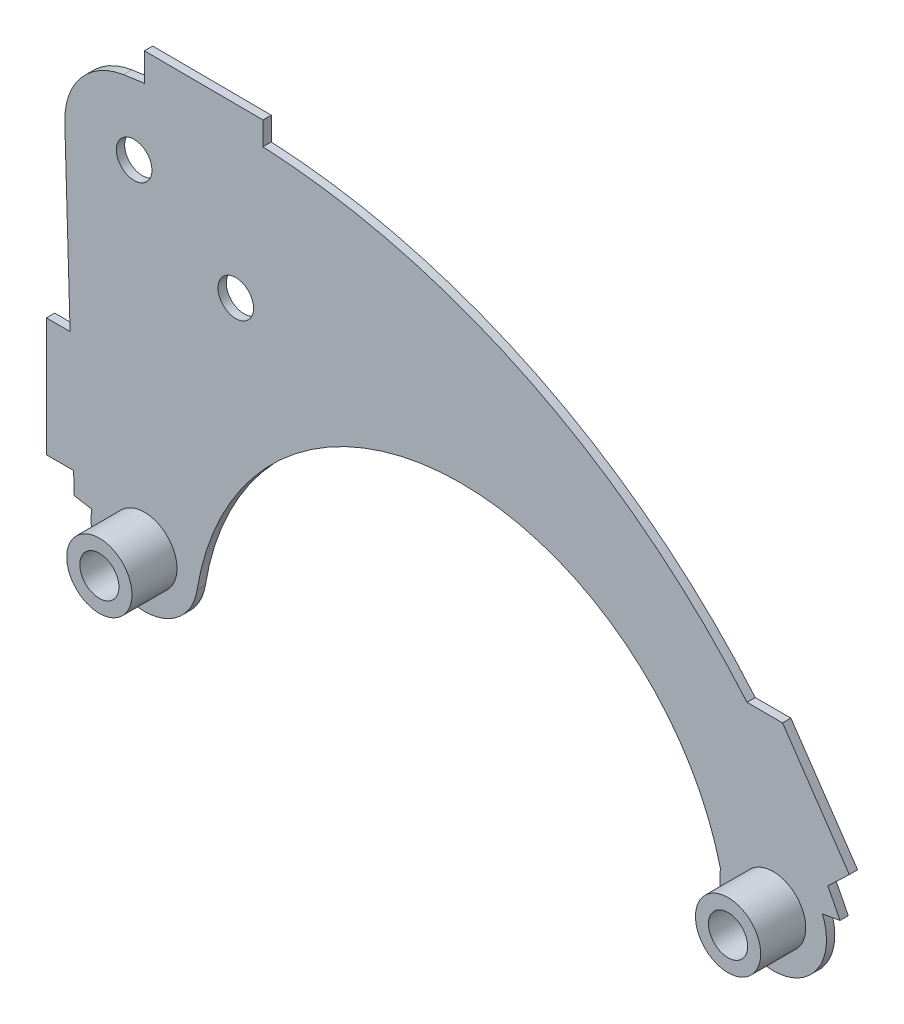
ISO-10303-21;
HEADER;
FILE_DESCRIPTION(('STEP AP214'),'2;1');
FILE_NAME('part.step','',(''),(''),'','','');
FILE_SCHEMA(('AUTOMOTIVE_DESIGN { 1 0 10303 214 1 1 1 1 }'));
ENDSEC;
DATA;
#1=APPLICATION_CONTEXT('core data for automotive mechanical design processes');
#2=APPLICATION_PROTOCOL_DEFINITION('international standard','automotive_design',2000,#1);
#3=PRODUCT_CONTEXT('',#1,'mechanical');
#4=PRODUCT('Part','Part','',(#3));
#5=PRODUCT_RELATED_PRODUCT_CATEGORY('part','',(#4));
#6=PRODUCT_DEFINITION_FORMATION('','',#4);
#7=PRODUCT_DEFINITION_CONTEXT('part definition',#1,'design');
#8=PRODUCT_DEFINITION('design','',#6,#7);
#9=PRODUCT_DEFINITION_SHAPE('','',#8);
#10=(LENGTH_UNIT() NAMED_UNIT(*) SI_UNIT(.MILLI.,.METRE.));
#11=(NAMED_UNIT(*) PLANE_ANGLE_UNIT() SI_UNIT($,.RADIAN.));
#12=(NAMED_UNIT(*) SI_UNIT($,.STERADIAN.) SOLID_ANGLE_UNIT());
#13=UNCERTAINTY_MEASURE_WITH_UNIT(LENGTH_MEASURE(1.E-05),#10,'distance_accuracy_value','');
#14=(GEOMETRIC_REPRESENTATION_CONTEXT(3) GLOBAL_UNCERTAINTY_ASSIGNED_CONTEXT((#13)) GLOBAL_UNIT_ASSIGNED_CONTEXT((#10,
#11,#12)) REPRESENTATION_CONTEXT('',''));
#15=CARTESIAN_POINT('',(0.,0.,0.));
#16=DIRECTION('',(0.,0.,1.));
#17=DIRECTION('',(1.,0.,0.));
#18=AXIS2_PLACEMENT_3D('',#15,#16,#17);
#19=CARTESIAN_POINT('',(-192.707076218779,-184.284598923351,7.));
#20=DIRECTION('',(0.,0.,-1.));
#21=DIRECTION('',(-1.,0.,0.));
#22=AXIS2_PLACEMENT_3D('',#19,#20,#21);
#23=CYLINDRICAL_SURFACE('',#22,573.469503846789);
#24=CARTESIAN_POINT('',(-192.707076218779,-184.284598923351,0.));
#25=DIRECTION('',(0.,0.,1.));
#26=DIRECTION('',(1.,0.,0.));
#27=AXIS2_PLACEMENT_3D('',#24,#25,#26);
#28=CIRCLE('',#27,573.469503846789);
#29=CARTESIAN_POINT('',(322.942948353425,66.6582710709314,0.));
#30=VERTEX_POINT('',#29);
#31=CARTESIAN_POINT('',(312.652861422029,86.7847746140521,0.));
#32=VERTEX_POINT('',#31);
#33=EDGE_CURVE('E344',#30,#32,#28,.T.);
#34=ORIENTED_EDGE('',*,*,#33,.T.);
#35=DIRECTION('',(0.,0.,1.));
#36=VECTOR('',#35,1.);
#37=CARTESIAN_POINT('',(312.652861422028,86.7847746140535,-132.090595462372));
#38=LINE('',#37,#36);
#39=CARTESIAN_POINT('',(312.652861422029,86.7847746140521,7.));
#40=VERTEX_POINT('',#39);
#41=EDGE_CURVE('E64',#32,#40,#38,.T.);
#42=ORIENTED_EDGE('',*,*,#41,.T.);
#43=CARTESIAN_POINT('',(-192.707076218779,-184.284598923351,7.));
#44=DIRECTION('',(0.,0.,1.));
#45=DIRECTION('',(1.,0.,0.));
#46=AXIS2_PLACEMENT_3D('',#43,#44,#45);
#47=CIRCLE('',#46,573.469503846789);
#48=CARTESIAN_POINT('',(322.942948353425,66.6582710709314,7.));
#49=VERTEX_POINT('',#48);
#50=EDGE_CURVE('E215',#49,#40,#47,.T.);
#51=ORIENTED_EDGE('',*,*,#50,.F.);
#52=DIRECTION('',(0.,0.,-1.));
#53=VECTOR('',#52,1.);
#54=CARTESIAN_POINT('',(322.942948353425,66.6582710709314,7.));
#55=LINE('',#54,#53);
#56=EDGE_CURVE('E11',#49,#30,#55,.T.);
#57=ORIENTED_EDGE('',*,*,#56,.T.);
#58=EDGE_LOOP('',(#34,#42,#51,#57));
#59=FACE_BOUND('',#58,.T.);
#60=ADVANCED_FACE('F41',(#59),#23,.T.);
#61=CARTESIAN_POINT('',(244.528320180963,186.784774614054,7.));
#62=VERTEX_POINT('',#61);
#63=CARTESIAN_POINT('',(-163.635450853397,388.447548280642,7.));
#64=VERTEX_POINT('',#63);
#65=EDGE_CURVE('E56',#62,#64,#47,.T.);
#66=ORIENTED_EDGE('',*,*,#65,.F.);
#67=DIRECTION('',(0.,0.,1.));
#68=VECTOR('',#67,1.);
#69=CARTESIAN_POINT('',(244.528320180963,186.784774614054,-132.090595462372));
#70=LINE('',#69,#68);
#71=CARTESIAN_POINT('',(244.528320180963,186.784774614054,0.));
#72=VERTEX_POINT('',#71);
#73=EDGE_CURVE('E223',#72,#62,#70,.T.);
#74=ORIENTED_EDGE('',*,*,#73,.F.);
#75=CARTESIAN_POINT('',(-163.635450853397,388.447548280642,0.));
#76=VERTEX_POINT('',#75);
#77=EDGE_CURVE('E347',#72,#76,#28,.T.);
#78=ORIENTED_EDGE('',*,*,#77,.T.);
#79=DIRECTION('',(0.,0.,-1.));
#80=VECTOR('',#79,1.);
#81=CARTESIAN_POINT('',(-163.635450853397,388.447548280642,7.));
#82=LINE('',#81,#80);
#83=EDGE_CURVE('E251',#76,#64,#82,.F.);
#84=ORIENTED_EDGE('',*,*,#83,.T.);
#85=EDGE_LOOP('',(#66,#74,#78,#84));
#86=FACE_BOUND('',#85,.T.);
#87=ADVANCED_FACE('F404',(#86),#23,.T.);
#88=CARTESIAN_POINT('',(-320.932430468004,-9.49371903301343,7.));
#89=DIRECTION('',(-0.999562749185393,-0.0295687409427409,0.));
#90=DIRECTION('',(0.0295687409427409,-0.999562749185393,0.));
#91=AXIS2_PLACEMENT_3D('',#88,#89,#90);
#92=PLANE('',#91);
#93=DIRECTION('',(0.,0.,1.));
#94=VECTOR('',#93,1.);
#95=CARTESIAN_POINT('',(-323.347893363374,72.1603066465592,-132.090595462372));
#96=LINE('',#95,#94);
#97=CARTESIAN_POINT('',(-323.347893363374,72.1603066465592,0.));
#98=VERTEX_POINT('',#97);
#99=CARTESIAN_POINT('',(-323.347893363374,72.1603066465592,7.));
#100=VERTEX_POINT('',#99);
#101=EDGE_CURVE('E257',#98,#100,#96,.T.);
#102=ORIENTED_EDGE('',*,*,#101,.F.);
#103=DIRECTION('',(-0.0295687409427408,0.999562749185393,0.));
#104=VECTOR('',#103,1.);
#105=CARTESIAN_POINT('',(-320.932430468004,-9.49371903301343,0.));
#106=LINE('',#105,#104);
#107=CARTESIAN_POINT('',(-322.811275447721,54.0200929637776,0.));
#108=VERTEX_POINT('',#107);
#109=EDGE_CURVE('E351',#108,#98,#106,.T.);
#110=ORIENTED_EDGE('',*,*,#109,.F.);
#111=DIRECTION('',(0.,0.,-1.));
#112=VECTOR('',#111,1.);
#113=CARTESIAN_POINT('',(-322.811275447721,54.0200929637776,7.));
#114=LINE('',#113,#112);
#115=CARTESIAN_POINT('',(-322.811275447721,54.0200929637776,7.));
#116=VERTEX_POINT('',#115);
#117=EDGE_CURVE('E380',#116,#108,#114,.T.);
#118=ORIENTED_EDGE('',*,*,#117,.F.);
#119=DIRECTION('',(-0.0295687409427408,0.999562749185393,0.));
#120=VECTOR('',#119,1.);
#121=CARTESIAN_POINT('',(-320.932430468004,-9.49371903301343,7.));
#122=LINE('',#121,#120);
#123=EDGE_CURVE('E312',#116,#100,#122,.T.);
#124=ORIENTED_EDGE('',*,*,#123,.T.);
#125=EDGE_LOOP('',(#102,#110,#118,#124));
#126=FACE_BOUND('',#125,.T.);
#127=ADVANCED_FACE('F432',(#126),#92,.T.);
#128=CARTESIAN_POINT('',(0.,0.,7.));
#129=DIRECTION('',(0.,0.,1.));
#130=DIRECTION('',(1.,0.,0.));
#131=AXIS2_PLACEMENT_3D('',#128,#129,#130);
#132=PLANE('',#131);
#133=ORIENTED_EDGE('',*,*,#50,.T.);
#134=DIRECTION('',(0.723263400313583,0.690572265419655,0.));
#135=VECTOR('',#134,1.);
#136=CARTESIAN_POINT('',(330.829684072874,104.140014199913,7.));
#137=LINE('',#136,#135);
#138=CARTESIAN_POINT('',(330.829684072874,104.140014199913,7.));
#139=VERTEX_POINT('',#138);
#140=EDGE_CURVE('E196',#40,#139,#137,.T.);
#141=ORIENTED_EDGE('',*,*,#140,.T.);
#142=DIRECTION('',(-0.563013638919106,0.826447604141404,0.));
#143=VECTOR('',#142,1.);
#144=CARTESIAN_POINT('',(274.528320180963,186.784774614053,7.));
#145=LINE('',#144,#143);
#146=CARTESIAN_POINT('',(274.528320180963,186.784774614053,7.));
#147=VERTEX_POINT('',#146);
#148=EDGE_CURVE('E205',#139,#147,#145,.T.);
#149=ORIENTED_EDGE('',*,*,#148,.T.);
#150=DIRECTION('',(-1.,0.,0.));
#151=VECTOR('',#150,1.);
#152=CARTESIAN_POINT('',(274.528320180963,186.784774614053,7.));
#153=LINE('',#152,#151);
#154=EDGE_CURVE('E202',#147,#62,#153,.T.);
#155=ORIENTED_EDGE('',*,*,#154,.T.);
#156=ORIENTED_EDGE('',*,*,#65,.T.);
#157=DIRECTION('',(0.,1.,0.));
#158=VECTOR('',#157,1.);
#159=CARTESIAN_POINT('',(-163.635450853396,408.029879984164,7.));
#160=LINE('',#159,#158);
#161=CARTESIAN_POINT('',(-163.635450853396,408.029879984164,7.));
#162=VERTEX_POINT('',#161);
#163=EDGE_CURVE('E241',#64,#162,#160,.T.);
#164=ORIENTED_EDGE('',*,*,#163,.T.);
#165=DIRECTION('',(-0.999986904375058,0.00511772199215999,0.));
#166=VECTOR('',#165,1.);
#167=CARTESIAN_POINT('',(-263.634141290902,408.541652183381,7.));
#168=LINE('',#167,#166);
#169=CARTESIAN_POINT('',(-263.634141290902,408.541652183381,7.));
#170=VERTEX_POINT('',#169);
#171=EDGE_CURVE('E228',#162,#170,#168,.T.);
#172=ORIENTED_EDGE('',*,*,#171,.T.);
#173=DIRECTION('',(0.,-1.,0.));
#174=VECTOR('',#173,1.);
#175=CARTESIAN_POINT('',(-263.634141290902,408.541652183381,7.));
#176=LINE('',#175,#174);
#177=CARTESIAN_POINT('',(-263.634141290902,384.781849993238,7.));
#178=VERTEX_POINT('',#177);
#179=EDGE_CURVE('E238',#170,#178,#176,.T.);
#180=ORIENTED_EDGE('',*,*,#179,.T.);
#181=CARTESIAN_POINT('',(-281.327086526287,382.296168148193,7.));
#182=VERTEX_POINT('',#181);
#183=EDGE_CURVE('E306',#178,#182,#47,.T.);
#184=ORIENTED_EDGE('',*,*,#183,.T.);
#185=CARTESIAN_POINT('',(-272.286901183886,324.498892702243,7.));
#186=DIRECTION('',(0.,0.,1.));
#187=DIRECTION('',(1.,0.,0.));
#188=AXIS2_PLACEMENT_3D('',#185,#186,#187);
#189=CIRCLE('',#188,58.5);
#190=CARTESIAN_POINT('',(-330.761322011232,322.769121357092,7.));
#191=VERTEX_POINT('',#190);
#192=EDGE_CURVE('E308',#182,#191,#189,.T.);
#193=ORIENTED_EDGE('',*,*,#192,.T.);
#194=CARTESIAN_POINT('',(-326.306060918821,172.160306646559,7.));
#195=VERTEX_POINT('',#194);
#196=EDGE_CURVE('E311',#195,#191,#122,.T.);
#197=ORIENTED_EDGE('',*,*,#196,.F.);
#198=DIRECTION('',(-1.,0.,0.));
#199=VECTOR('',#198,1.);
#200=CARTESIAN_POINT('',(-326.306060918821,172.160306646559,7.));
#201=LINE('',#200,#199);
#202=CARTESIAN_POINT('',(-346.306060918821,172.160306646559,7.));
#203=VERTEX_POINT('',#202);
#204=EDGE_CURVE('E253',#195,#203,#201,.T.);
#205=ORIENTED_EDGE('',*,*,#204,.T.);
#206=DIRECTION('',(0.,-1.,0.));
#207=VECTOR('',#206,1.);
#208=CARTESIAN_POINT('',(-346.306060918821,172.160306646559,7.));
#209=LINE('',#208,#207);
#210=CARTESIAN_POINT('',(-346.306060918821,72.1603066465592,7.));
#211=VERTEX_POINT('',#210);
#212=EDGE_CURVE('E262',#203,#211,#209,.T.);
#213=ORIENTED_EDGE('',*,*,#212,.T.);
#214=DIRECTION('',(1.,0.,0.));
#215=VECTOR('',#214,1.);
#216=CARTESIAN_POINT('',(-346.306060918821,72.1603066465592,7.));
#217=LINE('',#216,#215);
#218=EDGE_CURVE('E265',#211,#100,#217,.T.);
#219=ORIENTED_EDGE('',*,*,#218,.T.);
#220=ORIENTED_EDGE('',*,*,#123,.F.);
#221=DIRECTION('',(-0.986285569280313,0.165047798620306,0.));
#222=VECTOR('',#221,1.);
#223=CARTESIAN_POINT('',(-8.62227936014492E-06,-5.15246478796E-05,7.));
#224=LINE('',#223,#222);
#225=CARTESIAN_POINT('',(-308.016991908516,51.544375984473,7.));
#226=VERTEX_POINT('',#225);
#227=EDGE_CURVE('E315',#226,#116,#224,.T.);
#228=ORIENTED_EDGE('',*,*,#227,.F.);
#229=CARTESIAN_POINT('',(-263.634141290902,44.1172250465592,7.));
#230=DIRECTION('',(0.,0.,1.));
#231=DIRECTION('',(1.,0.,0.));
#232=AXIS2_PLACEMENT_3D('',#229,#230,#231);
#233=CIRCLE('',#232,44.9999999999999);
#234=CARTESIAN_POINT('',(-263.634141290902,-0.882774953440794,7.));
#235=VERTEX_POINT('',#234);
#236=EDGE_CURVE('E318',#226,#235,#233,.T.);
#237=ORIENTED_EDGE('',*,*,#236,.T.);
#238=DIRECTION('',(0.999974002488679,0.00721071055936465,0.));
#239=VECTOR('',#238,1.);
#240=CARTESIAN_POINT('',(-0.0073422157700782,1.0182110112859,7.));
#241=LINE('',#240,#239);
#242=CARTESIAN_POINT('',(-262.985194212018,-0.878095462231509,7.));
#243=VERTEX_POINT('',#242);
#244=EDGE_CURVE('E320',#235,#243,#241,.T.);
#245=ORIENTED_EDGE('',*,*,#244,.T.);
#246=CARTESIAN_POINT('',(-219.209238470738,36.9458925749064,7.));
#247=VERTEX_POINT('',#246);
#248=EDGE_CURVE('E321',#243,#247,#233,.T.);
#249=ORIENTED_EDGE('',*,*,#248,.T.);
#250=CARTESIAN_POINT('',(3.21144164888322,1.04142133349768,7.));
#251=DIRECTION('',(0.,0.,1.));
#252=DIRECTION('',(1.,0.,0.));
#253=AXIS2_PLACEMENT_3D('',#250,#251,#252);
#254=CIRCLE('',#253,225.3);
#255=CARTESIAN_POINT('',(222.170009850152,54.1190570311286,7.));
#256=VERTEX_POINT('',#255);
#257=EDGE_CURVE('E323',#256,#247,#254,.T.);
#258=ORIENTED_EDGE('',*,*,#257,.F.);
#259=CARTESIAN_POINT('',(266.568301500018,46.7847746140535,7.));
#260=DIRECTION('',(0.,0.,1.));
#261=DIRECTION('',(1.,0.,0.));
#262=AXIS2_PLACEMENT_3D('',#259,#260,#261);
#263=CIRCLE('',#262,45.);
#264=CARTESIAN_POINT('',(308.11587010362,64.0705937479262,7.));
#265=VERTEX_POINT('',#264);
#266=EDGE_CURVE('E326',#256,#265,#263,.T.);
#267=ORIENTED_EDGE('',*,*,#266,.T.);
#268=DIRECTION('',(0.985110024766589,0.171925097366177,0.));
#269=VECTOR('',#268,1.);
#270=CARTESIAN_POINT('',(-1.74396232257102,9.99269328968787,7.));
#271=LINE('',#270,#269);
#272=EDGE_CURVE('E304',#265,#49,#271,.T.);
#273=ORIENTED_EDGE('',*,*,#272,.T.);
#274=EDGE_LOOP('',(#133,#141,#149,#155,#156,#164,#172,#180,#184,#193,#197,#205,#213,#219,#220,
#228,#237,#245,#249,#258,#267,#273));
#275=FACE_BOUND('',#274,.T.);
#276=CARTESIAN_POINT('',(-263.634141290902,44.1172250465592,7.));
#277=DIRECTION('',(0.,0.,1.));
#278=DIRECTION('',(1.,0.,0.));
#279=AXIS2_PLACEMENT_3D('',#276,#277,#278);
#280=CIRCLE('',#279,27.5);
#281=CARTESIAN_POINT('',(-236.134141290902,44.1172250465592,7.));
#282=VERTEX_POINT('',#281);
#283=EDGE_CURVE('E290',#282,#282,#280,.T.);
#284=ORIENTED_EDGE('',*,*,#283,.F.);
#285=EDGE_LOOP('',(#284));
#286=FACE_BOUND('',#285,.T.);
#287=CARTESIAN_POINT('',(-186.584414744995,266.470160007209,7.));
#288=DIRECTION('',(0.,0.,1.));
#289=DIRECTION('',(1.,0.,0.));
#290=AXIS2_PLACEMENT_3D('',#287,#288,#289);
#291=CIRCLE('',#290,15.);
#292=CARTESIAN_POINT('',(-171.584414744995,266.470160007209,7.));
#293=VERTEX_POINT('',#292);
#294=EDGE_CURVE('E297',#293,#293,#291,.T.);
#295=ORIENTED_EDGE('',*,*,#294,.F.);
#296=EDGE_LOOP('',(#295));
#297=FACE_BOUND('',#296,.T.);
#298=CARTESIAN_POINT('',(-272.286901183886,324.498892702243,7.));
#299=DIRECTION('',(0.,0.,1.));
#300=DIRECTION('',(1.,0.,0.));
#301=AXIS2_PLACEMENT_3D('',#298,#299,#300);
#302=CIRCLE('',#301,15.);
#303=CARTESIAN_POINT('',(-257.286901183886,324.498892702243,7.));
#304=VERTEX_POINT('',#303);
#305=EDGE_CURVE('E300',#304,#304,#302,.T.);
#306=ORIENTED_EDGE('',*,*,#305,.F.);
#307=EDGE_LOOP('',(#306));
#308=FACE_BOUND('',#307,.T.);
#309=CARTESIAN_POINT('',(266.568301500018,46.7847746140535,7.));
#310=DIRECTION('',(0.,0.,1.));
#311=DIRECTION('',(1.,0.,0.));
#312=AXIS2_PLACEMENT_3D('',#309,#310,#311);
#313=CIRCLE('',#312,27.5);
#314=CARTESIAN_POINT('',(294.068301500018,46.7847746140535,7.));
#315=VERTEX_POINT('',#314);
#316=EDGE_CURVE('E281',#315,#315,#313,.T.);
#317=ORIENTED_EDGE('',*,*,#316,.F.);
#318=EDGE_LOOP('',(#317));
#319=FACE_BOUND('',#318,.T.);
#320=ADVANCED_FACE('F212',(#275,#286,#297,#308,#319),#132,.T.);
#321=CARTESIAN_POINT('',(-1.74396232257102,9.99269328968787,7.));
#322=DIRECTION('',(-0.171925097366177,0.985110024766589,0.));
#323=DIRECTION('',(-0.98511002476659,-0.171925097366177,0.));
#324=AXIS2_PLACEMENT_3D('',#321,#322,#323);
#325=PLANE('',#324);
#326=DIRECTION('',(0.985110024766589,0.171925097366177,0.));
#327=VECTOR('',#326,1.);
#328=CARTESIAN_POINT('',(-1.74396232257102,9.99269328968787,0.));
#329=LINE('',#328,#327);
#330=CARTESIAN_POINT('',(308.11587010362,64.0705937479262,0.));
#331=VERTEX_POINT('',#330);
#332=EDGE_CURVE('E340',#331,#30,#329,.T.);
#333=ORIENTED_EDGE('',*,*,#332,.T.);
#334=ORIENTED_EDGE('',*,*,#56,.F.);
#335=ORIENTED_EDGE('',*,*,#272,.F.);
#336=DIRECTION('',(0.,0.,-1.));
#337=VECTOR('',#336,1.);
#338=CARTESIAN_POINT('',(308.11587010362,64.0705937479262,7.));
#339=LINE('',#338,#337);
#340=EDGE_CURVE('E328',#265,#331,#339,.T.);
#341=ORIENTED_EDGE('',*,*,#340,.T.);
#342=EDGE_LOOP('',(#333,#334,#335,#341));
#343=FACE_BOUND('',#342,.T.);
#344=ADVANCED_FACE('F419',(#343),#325,.F.);
#345=ORIENTED_EDGE('',*,*,#183,.F.);
#346=DIRECTION('',(0.,0.,-1.));
#347=VECTOR('',#346,1.);
#348=CARTESIAN_POINT('',(-263.634141290902,384.781849993238,7.));
#349=LINE('',#348,#347);
#350=CARTESIAN_POINT('',(-263.634141290902,384.781849993238,0.));
#351=VERTEX_POINT('',#350);
#352=EDGE_CURVE('E248',#178,#351,#349,.T.);
#353=ORIENTED_EDGE('',*,*,#352,.T.);
#354=CARTESIAN_POINT('',(-281.327086526287,382.296168148193,0.));
#355=VERTEX_POINT('',#354);
#356=EDGE_CURVE('E343',#351,#355,#28,.T.);
#357=ORIENTED_EDGE('',*,*,#356,.T.);
#358=DIRECTION('',(0.,0.,-1.));
#359=VECTOR('',#358,1.);
#360=CARTESIAN_POINT('',(-281.327086526287,382.296168148193,7.));
#361=LINE('',#360,#359);
#362=EDGE_CURVE('E49',#182,#355,#361,.T.);
#363=ORIENTED_EDGE('',*,*,#362,.F.);
#364=EDGE_LOOP('',(#345,#353,#357,#363));
#365=FACE_BOUND('',#364,.T.);
#366=ADVANCED_FACE('F417',(#365),#23,.T.);
#367=CARTESIAN_POINT('',(-272.286901183886,324.498892702243,7.));
#368=DIRECTION('',(0.,0.,-1.));
#369=DIRECTION('',(-1.,0.,0.));
#370=AXIS2_PLACEMENT_3D('',#367,#368,#369);
#371=CYLINDRICAL_SURFACE('',#370,58.5);
#372=CARTESIAN_POINT('',(-272.286901183886,324.498892702243,0.));
#373=DIRECTION('',(0.,0.,1.));
#374=DIRECTION('',(1.,0.,0.));
#375=AXIS2_PLACEMENT_3D('',#372,#373,#374);
#376=CIRCLE('',#375,58.5);
#377=CARTESIAN_POINT('',(-330.761322011232,322.769121357092,0.));
#378=VERTEX_POINT('',#377);
#379=EDGE_CURVE('E346',#355,#378,#376,.T.);
#380=ORIENTED_EDGE('',*,*,#379,.T.);
#381=DIRECTION('',(0.,0.,-1.));
#382=VECTOR('',#381,1.);
#383=CARTESIAN_POINT('',(-330.761322011232,322.769121357092,7.));
#384=LINE('',#383,#382);
#385=EDGE_CURVE('E382',#191,#378,#384,.T.);
#386=ORIENTED_EDGE('',*,*,#385,.F.);
#387=ORIENTED_EDGE('',*,*,#192,.F.);
#388=ORIENTED_EDGE('',*,*,#362,.T.);
#389=EDGE_LOOP('',(#380,#386,#387,#388));
#390=FACE_BOUND('',#389,.T.);
#391=ADVANCED_FACE('F389',(#390),#371,.T.);
#392=DIRECTION('',(0.,0.,1.));
#393=VECTOR('',#392,1.);
#394=CARTESIAN_POINT('',(-326.306060918821,172.160306646559,-132.090595462372));
#395=LINE('',#394,#393);
#396=CARTESIAN_POINT('',(-326.306060918821,172.160306646559,0.));
#397=VERTEX_POINT('',#396);
#398=EDGE_CURVE('E268',#397,#195,#395,.T.);
#399=ORIENTED_EDGE('',*,*,#398,.T.);
#400=ORIENTED_EDGE('',*,*,#196,.T.);
#401=ORIENTED_EDGE('',*,*,#385,.T.);
#402=EDGE_CURVE('E350',#397,#378,#106,.T.);
#403=ORIENTED_EDGE('',*,*,#402,.F.);
#404=EDGE_LOOP('',(#399,#400,#401,#403));
#405=FACE_BOUND('',#404,.T.);
#406=ADVANCED_FACE('F398',(#405),#92,.T.);
#407=CARTESIAN_POINT('',(-8.62227936014492E-06,-5.15246478796E-05,7.));
#408=DIRECTION('',(-0.165047798620306,-0.986285569280313,0.));
#409=DIRECTION('',(0.986285569280313,-0.165047798620306,0.));
#410=AXIS2_PLACEMENT_3D('',#407,#408,#409);
#411=PLANE('',#410);
#412=DIRECTION('',(-0.986285569280313,0.165047798620306,0.));
#413=VECTOR('',#412,1.);
#414=CARTESIAN_POINT('',(-8.62227936014492E-06,-5.15246478796E-05,0.));
#415=LINE('',#414,#413);
#416=CARTESIAN_POINT('',(-308.016991908516,51.544375984473,0.));
#417=VERTEX_POINT('',#416);
#418=EDGE_CURVE('E354',#417,#108,#415,.T.);
#419=ORIENTED_EDGE('',*,*,#418,.F.);
#420=DIRECTION('',(0.,0.,-1.));
#421=VECTOR('',#420,1.);
#422=CARTESIAN_POINT('',(-308.016991908516,51.544375984473,7.));
#423=LINE('',#422,#421);
#424=EDGE_CURVE('E378',#226,#417,#423,.T.);
#425=ORIENTED_EDGE('',*,*,#424,.F.);
#426=ORIENTED_EDGE('',*,*,#227,.T.);
#427=ORIENTED_EDGE('',*,*,#117,.T.);
#428=EDGE_LOOP('',(#419,#425,#426,#427));
#429=FACE_BOUND('',#428,.T.);
#430=ADVANCED_FACE('F444',(#429),#411,.T.);
#431=CARTESIAN_POINT('',(-263.634141290902,44.1172250465592,7.));
#432=DIRECTION('',(0.,0.,-1.));
#433=DIRECTION('',(-1.,0.,0.));
#434=AXIS2_PLACEMENT_3D('',#431,#432,#433);
#435=CYLINDRICAL_SURFACE('',#434,44.9999999999999);
#436=CARTESIAN_POINT('',(-263.634141290902,44.1172250465592,0.));
#437=DIRECTION('',(0.,0.,1.));
#438=DIRECTION('',(1.,0.,0.));
#439=AXIS2_PLACEMENT_3D('',#436,#437,#438);
#440=CIRCLE('',#439,44.9999999999999);
#441=CARTESIAN_POINT('',(-263.634141290902,-0.882774953440794,0.));
#442=VERTEX_POINT('',#441);
#443=EDGE_CURVE('E357',#417,#442,#440,.T.);
#444=ORIENTED_EDGE('',*,*,#443,.T.);
#445=DIRECTION('',(0.,0.,-1.));
#446=VECTOR('',#445,1.);
#447=CARTESIAN_POINT('',(-263.634141290902,-0.882774953440794,7.));
#448=LINE('',#447,#446);
#449=EDGE_CURVE('E375',#235,#442,#448,.T.);
#450=ORIENTED_EDGE('',*,*,#449,.F.);
#451=ORIENTED_EDGE('',*,*,#236,.F.);
#452=ORIENTED_EDGE('',*,*,#424,.T.);
#453=EDGE_LOOP('',(#444,#450,#451,#452));
#454=FACE_BOUND('',#453,.T.);
#455=ADVANCED_FACE('F449',(#454),#435,.T.);
#456=CARTESIAN_POINT('',(-0.0073422157700782,1.0182110112859,7.));
#457=DIRECTION('',(-0.00721071055936465,0.999974002488679,0.));
#458=DIRECTION('',(-0.999974002488679,-0.00721071055936465,0.));
#459=AXIS2_PLACEMENT_3D('',#456,#457,#458);
#460=PLANE('',#459);
#461=DIRECTION('',(0.999974002488679,0.00721071055936465,0.));
#462=VECTOR('',#461,1.);
#463=CARTESIAN_POINT('',(-0.0073422157700782,1.0182110112859,0.));
#464=LINE('',#463,#462);
#465=CARTESIAN_POINT('',(-262.985194212018,-0.878095462231509,0.));
#466=VERTEX_POINT('',#465);
#467=EDGE_CURVE('E359',#442,#466,#464,.T.);
#468=ORIENTED_EDGE('',*,*,#467,.T.);
#469=DIRECTION('',(0.,0.,-1.));
#470=VECTOR('',#469,1.);
#471=CARTESIAN_POINT('',(-262.985194212018,-0.878095462231509,7.));
#472=LINE('',#471,#470);
#473=EDGE_CURVE('E372',#243,#466,#472,.T.);
#474=ORIENTED_EDGE('',*,*,#473,.F.);
#475=ORIENTED_EDGE('',*,*,#244,.F.);
#476=ORIENTED_EDGE('',*,*,#449,.T.);
#477=EDGE_LOOP('',(#468,#474,#475,#476));
#478=FACE_BOUND('',#477,.T.);
#479=ADVANCED_FACE('F454',(#478),#460,.F.);
#480=CARTESIAN_POINT('',(-219.209238470738,36.9458925749064,0.));
#481=VERTEX_POINT('',#480);
#482=EDGE_CURVE('E360',#466,#481,#440,.T.);
#483=ORIENTED_EDGE('',*,*,#482,.T.);
#484=DIRECTION('',(0.,0.,-1.));
#485=VECTOR('',#484,1.);
#486=CARTESIAN_POINT('',(-219.209238470738,36.9458925749064,7.));
#487=LINE('',#486,#485);
#488=EDGE_CURVE('E370',#247,#481,#487,.T.);
#489=ORIENTED_EDGE('',*,*,#488,.F.);
#490=ORIENTED_EDGE('',*,*,#248,.F.);
#491=ORIENTED_EDGE('',*,*,#473,.T.);
#492=EDGE_LOOP('',(#483,#489,#490,#491));
#493=FACE_BOUND('',#492,.T.);
#494=ADVANCED_FACE('F457',(#493),#435,.T.);
#495=CARTESIAN_POINT('',(3.21144164888322,1.04142133349768,7.));
#496=DIRECTION('',(0.,0.,-1.));
#497=DIRECTION('',(-1.,0.,0.));
#498=AXIS2_PLACEMENT_3D('',#495,#496,#497);
#499=CYLINDRICAL_SURFACE('',#498,225.3);
#500=CARTESIAN_POINT('',(3.21144164888322,1.04142133349768,0.));
#501=DIRECTION('',(0.,0.,1.));
#502=DIRECTION('',(1.,0.,0.));
#503=AXIS2_PLACEMENT_3D('',#500,#501,#502);
#504=CIRCLE('',#503,225.3);
#505=CARTESIAN_POINT('',(222.170009850152,54.1190570311286,0.));
#506=VERTEX_POINT('',#505);
#507=EDGE_CURVE('E362',#506,#481,#504,.T.);
#508=ORIENTED_EDGE('',*,*,#507,.F.);
#509=DIRECTION('',(0.,0.,-1.));
#510=VECTOR('',#509,1.);
#511=CARTESIAN_POINT('',(222.170009850152,54.1190570311286,7.));
#512=LINE('',#511,#510);
#513=EDGE_CURVE('E368',#256,#506,#512,.T.);
#514=ORIENTED_EDGE('',*,*,#513,.F.);
#515=ORIENTED_EDGE('',*,*,#257,.T.);
#516=ORIENTED_EDGE('',*,*,#488,.T.);
#517=EDGE_LOOP('',(#508,#514,#515,#516));
#518=FACE_BOUND('',#517,.T.);
#519=ADVANCED_FACE('F464',(#518),#499,.F.);
#520=CARTESIAN_POINT('',(-272.286901183886,324.498892702243,7.));
#521=DIRECTION('',(0.,0.,-1.));
#522=DIRECTION('',(-1.,0.,0.));
#523=AXIS2_PLACEMENT_3D('',#520,#521,#522);
#524=CYLINDRICAL_SURFACE('',#523,15.);
#525=ORIENTED_EDGE('',*,*,#305,.T.);
#526=EDGE_LOOP('',(#525));
#527=FACE_BOUND('',#526,.T.);
#528=CARTESIAN_POINT('',(-272.286901183886,324.498892702243,0.));
#529=DIRECTION('',(0.,0.,1.));
#530=DIRECTION('',(1.,0.,0.));
#531=AXIS2_PLACEMENT_3D('',#528,#529,#530);
#532=CIRCLE('',#531,15.);
#533=CARTESIAN_POINT('',(-257.286901183886,324.498892702243,0.));
#534=VERTEX_POINT('',#533);
#535=EDGE_CURVE('E337',#534,#534,#532,.T.);
#536=ORIENTED_EDGE('',*,*,#535,.F.);
#537=EDGE_LOOP('',(#536));
#538=FACE_BOUND('',#537,.T.);
#539=ADVANCED_FACE('F468',(#527,#538),#524,.F.);
#540=CARTESIAN_POINT('',(266.568301500018,46.7847746140535,7.));
#541=DIRECTION('',(0.,0.,-1.));
#542=DIRECTION('',(-1.,0.,0.));
#543=AXIS2_PLACEMENT_3D('',#540,#541,#542);
#544=CYLINDRICAL_SURFACE('',#543,16.5000000000001);
#545=CARTESIAN_POINT('',(266.568301500018,46.7847746140535,0.));
#546=DIRECTION('',(0.,0.,1.));
#547=DIRECTION('',(1.,0.,0.));
#548=AXIS2_PLACEMENT_3D('',#545,#546,#547);
#549=CIRCLE('',#548,16.5000000000001);
#550=CARTESIAN_POINT('',(283.068301500018,46.7847746140535,0.));
#551=VERTEX_POINT('',#550);
#552=EDGE_CURVE('E334',#551,#551,#549,.T.);
#553=ORIENTED_EDGE('',*,*,#552,.F.);
#554=EDGE_LOOP('',(#553));
#555=FACE_BOUND('',#554,.T.);
#556=CARTESIAN_POINT('',(266.568301500018,46.7847746140535,45.));
#557=DIRECTION('',(0.,0.,1.));
#558=DIRECTION('',(1.,0.,0.));
#559=AXIS2_PLACEMENT_3D('',#556,#557,#558);
#560=CIRCLE('',#559,16.5000000000001);
#561=CARTESIAN_POINT('',(283.068301500018,46.7847746140535,45.));
#562=VERTEX_POINT('',#561);
#563=EDGE_CURVE('E278',#562,#562,#560,.T.);
#564=ORIENTED_EDGE('',*,*,#563,.T.);
#565=EDGE_LOOP('',(#564));
#566=FACE_BOUND('',#565,.T.);
#567=ADVANCED_FACE('F658',(#555,#566),#544,.F.);
#568=CARTESIAN_POINT('',(-263.634141290902,44.1172250465592,7.));
#569=DIRECTION('',(0.,0.,-1.));
#570=DIRECTION('',(-1.,0.,0.));
#571=AXIS2_PLACEMENT_3D('',#568,#569,#570);
#572=CYLINDRICAL_SURFACE('',#571,16.5);
#573=CARTESIAN_POINT('',(-263.634141290902,44.1172250465592,0.));
#574=DIRECTION('',(0.,0.,1.));
#575=DIRECTION('',(1.,0.,0.));
#576=AXIS2_PLACEMENT_3D('',#573,#574,#575);
#577=CIRCLE('',#576,16.5);
#578=CARTESIAN_POINT('',(-247.134141290902,44.1172250465592,0.));
#579=VERTEX_POINT('',#578);
#580=EDGE_CURVE('E331',#579,#579,#577,.T.);
#581=ORIENTED_EDGE('',*,*,#580,.F.);
#582=EDGE_LOOP('',(#581));
#583=FACE_BOUND('',#582,.T.);
#584=CARTESIAN_POINT('',(-263.634141290902,44.1172250465592,45.));
#585=DIRECTION('',(0.,0.,1.));
#586=DIRECTION('',(1.,0.,0.));
#587=AXIS2_PLACEMENT_3D('',#584,#585,#586);
#588=CIRCLE('',#587,16.5);
#589=CARTESIAN_POINT('',(-247.134141290902,44.1172250465592,45.));
#590=VERTEX_POINT('',#589);
#591=EDGE_CURVE('E285',#590,#590,#588,.T.);
#592=ORIENTED_EDGE('',*,*,#591,.T.);
#593=EDGE_LOOP('',(#592));
#594=FACE_BOUND('',#593,.T.);
#595=ADVANCED_FACE('F651',(#583,#594),#572,.F.);
#596=CARTESIAN_POINT('',(-186.584414744995,266.470160007209,7.));
#597=DIRECTION('',(0.,0.,-1.));
#598=DIRECTION('',(-1.,0.,0.));
#599=AXIS2_PLACEMENT_3D('',#596,#597,#598);
#600=CYLINDRICAL_SURFACE('',#599,15.);
#601=ORIENTED_EDGE('',*,*,#294,.T.);
#602=EDGE_LOOP('',(#601));
#603=FACE_BOUND('',#602,.T.);
#604=CARTESIAN_POINT('',(-186.584414744995,266.470160007209,0.));
#605=DIRECTION('',(0.,0.,1.));
#606=DIRECTION('',(1.,0.,0.));
#607=AXIS2_PLACEMENT_3D('',#604,#605,#606);
#608=CIRCLE('',#607,15.);
#609=CARTESIAN_POINT('',(-171.584414744995,266.470160007209,0.));
#610=VERTEX_POINT('',#609);
#611=EDGE_CURVE('E294',#610,#610,#608,.T.);
#612=ORIENTED_EDGE('',*,*,#611,.F.);
#613=EDGE_LOOP('',(#612));
#614=FACE_BOUND('',#613,.T.);
#615=ADVANCED_FACE('F43',(#603,#614),#600,.F.);
#616=CARTESIAN_POINT('',(266.568301500018,46.7847746140535,7.));
#617=DIRECTION('',(0.,0.,-1.));
#618=DIRECTION('',(-1.,0.,0.));
#619=AXIS2_PLACEMENT_3D('',#616,#617,#618);
#620=CYLINDRICAL_SURFACE('',#619,45.);
#621=CARTESIAN_POINT('',(266.568301500018,46.7847746140535,0.));
#622=DIRECTION('',(0.,0.,1.));
#623=DIRECTION('',(1.,0.,0.));
#624=AXIS2_PLACEMENT_3D('',#621,#622,#623);
#625=CIRCLE('',#624,45.);
#626=EDGE_CURVE('E301',#506,#331,#625,.T.);
#627=ORIENTED_EDGE('',*,*,#626,.T.);
#628=ORIENTED_EDGE('',*,*,#340,.F.);
#629=ORIENTED_EDGE('',*,*,#266,.F.);
#630=ORIENTED_EDGE('',*,*,#513,.T.);
#631=EDGE_LOOP('',(#627,#628,#629,#630));
#632=FACE_BOUND('',#631,.T.);
#633=ADVANCED_FACE('F470',(#632),#620,.T.);
#634=CARTESIAN_POINT('',(0.,0.,0.));
#635=DIRECTION('',(0.,0.,1.));
#636=DIRECTION('',(1.,0.,0.));
#637=AXIS2_PLACEMENT_3D('',#634,#635,#636);
#638=PLANE('',#637);
#639=ORIENTED_EDGE('',*,*,#77,.F.);
#640=DIRECTION('',(1.,0.,0.));
#641=VECTOR('',#640,1.);
#642=CARTESIAN_POINT('',(274.528320180963,186.784774614053,0.));
#643=LINE('',#642,#641);
#644=CARTESIAN_POINT('',(274.528320180963,186.784774614053,0.));
#645=VERTEX_POINT('',#644);
#646=EDGE_CURVE('E222',#72,#645,#643,.T.);
#647=ORIENTED_EDGE('',*,*,#646,.T.);
#648=DIRECTION('',(0.563013638919106,-0.826447604141404,0.));
#649=VECTOR('',#648,1.);
#650=CARTESIAN_POINT('',(274.528320180963,186.784774614053,0.));
#651=LINE('',#650,#649);
#652=CARTESIAN_POINT('',(330.829684072874,104.140014199913,0.));
#653=VERTEX_POINT('',#652);
#654=EDGE_CURVE('E226',#645,#653,#651,.T.);
#655=ORIENTED_EDGE('',*,*,#654,.T.);
#656=DIRECTION('',(-0.723263400313583,-0.690572265419655,0.));
#657=VECTOR('',#656,1.);
#658=CARTESIAN_POINT('',(330.829684072874,104.140014199913,0.));
#659=LINE('',#658,#657);
#660=EDGE_CURVE('E198',#653,#32,#659,.T.);
#661=ORIENTED_EDGE('',*,*,#660,.T.);
#662=ORIENTED_EDGE('',*,*,#33,.F.);
#663=ORIENTED_EDGE('',*,*,#332,.F.);
#664=ORIENTED_EDGE('',*,*,#626,.F.);
#665=ORIENTED_EDGE('',*,*,#507,.T.);
#666=ORIENTED_EDGE('',*,*,#482,.F.);
#667=ORIENTED_EDGE('',*,*,#467,.F.);
#668=ORIENTED_EDGE('',*,*,#443,.F.);
#669=ORIENTED_EDGE('',*,*,#418,.T.);
#670=ORIENTED_EDGE('',*,*,#109,.T.);
#671=DIRECTION('',(-1.,0.,0.));
#672=VECTOR('',#671,1.);
#673=CARTESIAN_POINT('',(-346.306060918821,72.1603066465592,0.));
#674=LINE('',#673,#672);
#675=CARTESIAN_POINT('',(-346.306060918821,72.1603066465592,0.));
#676=VERTEX_POINT('',#675);
#677=EDGE_CURVE('E256',#98,#676,#674,.T.);
#678=ORIENTED_EDGE('',*,*,#677,.T.);
#679=DIRECTION('',(0.,1.,0.));
#680=VECTOR('',#679,1.);
#681=CARTESIAN_POINT('',(-346.306060918821,172.160306646559,0.));
#682=LINE('',#681,#680);
#683=CARTESIAN_POINT('',(-346.306060918821,172.160306646559,0.));
#684=VERTEX_POINT('',#683);
#685=EDGE_CURVE('E254',#676,#684,#682,.T.);
#686=ORIENTED_EDGE('',*,*,#685,.T.);
#687=DIRECTION('',(1.,0.,0.));
#688=VECTOR('',#687,1.);
#689=CARTESIAN_POINT('',(-326.306060918821,172.160306646559,0.));
#690=LINE('',#689,#688);
#691=EDGE_CURVE('E259',#684,#397,#690,.T.);
#692=ORIENTED_EDGE('',*,*,#691,.T.);
#693=ORIENTED_EDGE('',*,*,#402,.T.);
#694=ORIENTED_EDGE('',*,*,#379,.F.);
#695=ORIENTED_EDGE('',*,*,#356,.F.);
#696=DIRECTION('',(0.,1.,0.));
#697=VECTOR('',#696,1.);
#698=CARTESIAN_POINT('',(-263.634141290902,408.541652183381,0.));
#699=LINE('',#698,#697);
#700=CARTESIAN_POINT('',(-263.634141290902,408.541652183381,0.));
#701=VERTEX_POINT('',#700);
#702=EDGE_CURVE('E235',#351,#701,#699,.T.);
#703=ORIENTED_EDGE('',*,*,#702,.T.);
#704=DIRECTION('',(0.999986904375058,-0.00511772199215999,0.));
#705=VECTOR('',#704,1.);
#706=CARTESIAN_POINT('',(-263.634141290902,408.541652183381,0.));
#707=LINE('',#706,#705);
#708=CARTESIAN_POINT('',(-163.635450853396,408.029879984164,0.));
#709=VERTEX_POINT('',#708);
#710=EDGE_CURVE('E232',#701,#709,#707,.T.);
#711=ORIENTED_EDGE('',*,*,#710,.T.);
#712=DIRECTION('',(0.,-1.,0.));
#713=VECTOR('',#712,1.);
#714=CARTESIAN_POINT('',(-163.635450853396,408.029879984164,0.));
#715=LINE('',#714,#713);
#716=EDGE_CURVE('E229',#709,#76,#715,.T.);
#717=ORIENTED_EDGE('',*,*,#716,.T.);
#718=EDGE_LOOP('',(#639,#647,#655,#661,#662,#663,#664,#665,#666,#667,#668,#669,#670,#678,#686,
#692,#693,#694,#695,#703,#711,#717));
#719=FACE_BOUND('',#718,.T.);
#720=ORIENTED_EDGE('',*,*,#611,.T.);
#721=EDGE_LOOP('',(#720));
#722=FACE_BOUND('',#721,.T.);
#723=ORIENTED_EDGE('',*,*,#580,.T.);
#724=EDGE_LOOP('',(#723));
#725=FACE_BOUND('',#724,.T.);
#726=ORIENTED_EDGE('',*,*,#552,.T.);
#727=EDGE_LOOP('',(#726));
#728=FACE_BOUND('',#727,.T.);
#729=ORIENTED_EDGE('',*,*,#535,.T.);
#730=EDGE_LOOP('',(#729));
#731=FACE_BOUND('',#730,.T.);
#732=ADVANCED_FACE('F393',(#719,#722,#725,#728,#731),#638,.F.);
#733=CARTESIAN_POINT('',(-263.634141290902,44.1172250465592,45.));
#734=DIRECTION('',(0.,0.,1.));
#735=DIRECTION('',(1.,0.,0.));
#736=AXIS2_PLACEMENT_3D('',#733,#734,#735);
#737=PLANE('',#736);
#738=CARTESIAN_POINT('',(-263.634141290902,44.1172250465592,45.));
#739=DIRECTION('',(0.,0.,1.));
#740=DIRECTION('',(1.,0.,0.));
#741=AXIS2_PLACEMENT_3D('',#738,#739,#740);
#742=CIRCLE('',#741,27.5);
#743=CARTESIAN_POINT('',(-236.134141290902,44.1172250465592,45.));
#744=VERTEX_POINT('',#743);
#745=EDGE_CURVE('E291',#744,#744,#742,.T.);
#746=ORIENTED_EDGE('',*,*,#745,.T.);
#747=EDGE_LOOP('',(#746));
#748=FACE_BOUND('',#747,.T.);
#749=ORIENTED_EDGE('',*,*,#591,.F.);
#750=EDGE_LOOP('',(#749));
#751=FACE_BOUND('',#750,.T.);
#752=ADVANCED_FACE('F475',(#748,#751),#737,.T.);
#753=CARTESIAN_POINT('',(-263.634141290902,44.1172250465592,45.));
#754=DIRECTION('',(0.,0.,-1.));
#755=DIRECTION('',(-1.,0.,0.));
#756=AXIS2_PLACEMENT_3D('',#753,#754,#755);
#757=CYLINDRICAL_SURFACE('',#756,27.5);
#758=ORIENTED_EDGE('',*,*,#745,.F.);
#759=EDGE_LOOP('',(#758));
#760=FACE_BOUND('',#759,.T.);
#761=ORIENTED_EDGE('',*,*,#283,.T.);
#762=EDGE_LOOP('',(#761));
#763=FACE_BOUND('',#762,.T.);
#764=ADVANCED_FACE('F477',(#760,#763),#757,.T.);
#765=CARTESIAN_POINT('',(266.568301500018,46.7847746140535,45.));
#766=DIRECTION('',(0.,0.,1.));
#767=DIRECTION('',(1.,0.,0.));
#768=AXIS2_PLACEMENT_3D('',#765,#766,#767);
#769=PLANE('',#768);
#770=CARTESIAN_POINT('',(266.568301500018,46.7847746140535,45.));
#771=DIRECTION('',(0.,0.,1.));
#772=DIRECTION('',(1.,0.,0.));
#773=AXIS2_PLACEMENT_3D('',#770,#771,#772);
#774=CIRCLE('',#773,27.5);
#775=CARTESIAN_POINT('',(294.068301500018,46.7847746140535,45.));
#776=VERTEX_POINT('',#775);
#777=EDGE_CURVE('E282',#776,#776,#774,.T.);
#778=ORIENTED_EDGE('',*,*,#777,.T.);
#779=EDGE_LOOP('',(#778));
#780=FACE_BOUND('',#779,.T.);
#781=ORIENTED_EDGE('',*,*,#563,.F.);
#782=EDGE_LOOP('',(#781));
#783=FACE_BOUND('',#782,.T.);
#784=ADVANCED_FACE('F480',(#780,#783),#769,.T.);
#785=CARTESIAN_POINT('',(266.568301500018,46.7847746140535,45.));
#786=DIRECTION('',(0.,0.,-1.));
#787=DIRECTION('',(-1.,0.,0.));
#788=AXIS2_PLACEMENT_3D('',#785,#786,#787);
#789=CYLINDRICAL_SURFACE('',#788,27.5);
#790=ORIENTED_EDGE('',*,*,#777,.F.);
#791=EDGE_LOOP('',(#790));
#792=FACE_BOUND('',#791,.T.);
#793=ORIENTED_EDGE('',*,*,#316,.T.);
#794=EDGE_LOOP('',(#793));
#795=FACE_BOUND('',#794,.T.);
#796=ADVANCED_FACE('F485',(#792,#795),#789,.T.);
#797=CARTESIAN_POINT('',(-346.306060918821,72.1603066465592,-132.090595462372));
#798=DIRECTION('',(0.,-1.,0.));
#799=DIRECTION('',(0.,0.,-1.));
#800=AXIS2_PLACEMENT_3D('',#797,#798,#799);
#801=PLANE('',#800);
#802=ORIENTED_EDGE('',*,*,#677,.F.);
#803=ORIENTED_EDGE('',*,*,#101,.T.);
#804=ORIENTED_EDGE('',*,*,#218,.F.);
#805=DIRECTION('',(0.,0.,1.));
#806=VECTOR('',#805,1.);
#807=CARTESIAN_POINT('',(-346.306060918821,72.1603066465592,-132.090595462372));
#808=LINE('',#807,#806);
#809=EDGE_CURVE('E270',#676,#211,#808,.T.);
#810=ORIENTED_EDGE('',*,*,#809,.F.);
#811=EDGE_LOOP('',(#802,#803,#804,#810));
#812=FACE_BOUND('',#811,.T.);
#813=ADVANCED_FACE('F488',(#812),#801,.T.);
#814=CARTESIAN_POINT('',(-346.306060918821,172.160306646559,-132.090595462372));
#815=DIRECTION('',(-1.,0.,0.));
#816=DIRECTION('',(0.,0.,1.));
#817=AXIS2_PLACEMENT_3D('',#814,#815,#816);
#818=PLANE('',#817);
#819=ORIENTED_EDGE('',*,*,#685,.F.);
#820=ORIENTED_EDGE('',*,*,#809,.T.);
#821=ORIENTED_EDGE('',*,*,#212,.F.);
#822=DIRECTION('',(0.,0.,1.));
#823=VECTOR('',#822,1.);
#824=CARTESIAN_POINT('',(-346.306060918821,172.160306646559,-132.090595462372));
#825=LINE('',#824,#823);
#826=EDGE_CURVE('E272',#684,#203,#825,.T.);
#827=ORIENTED_EDGE('',*,*,#826,.F.);
#828=EDGE_LOOP('',(#819,#820,#821,#827));
#829=FACE_BOUND('',#828,.T.);
#830=ADVANCED_FACE('F496',(#829),#818,.T.);
#831=CARTESIAN_POINT('',(-326.306060918821,172.160306646559,-132.090595462372));
#832=DIRECTION('',(0.,1.,0.));
#833=DIRECTION('',(0.,0.,1.));
#834=AXIS2_PLACEMENT_3D('',#831,#832,#833);
#835=PLANE('',#834);
#836=ORIENTED_EDGE('',*,*,#691,.F.);
#837=ORIENTED_EDGE('',*,*,#826,.T.);
#838=ORIENTED_EDGE('',*,*,#204,.F.);
#839=ORIENTED_EDGE('',*,*,#398,.F.);
#840=EDGE_LOOP('',(#836,#837,#838,#839));
#841=FACE_BOUND('',#840,.T.);
#842=ADVANCED_FACE('F493',(#841),#835,.T.);
#843=CARTESIAN_POINT('',(-163.635450853396,408.029879984164,-132.090595462372));
#844=DIRECTION('',(1.,0.,0.));
#845=DIRECTION('',(0.,1.,0.));
#846=AXIS2_PLACEMENT_3D('',#843,#844,#845);
#847=PLANE('',#846);
#848=ORIENTED_EDGE('',*,*,#83,.F.);
#849=ORIENTED_EDGE('',*,*,#716,.F.);
#850=DIRECTION('',(0.,0.,1.));
#851=VECTOR('',#850,1.);
#852=CARTESIAN_POINT('',(-163.635450853396,408.029879984164,-132.090595462372));
#853=LINE('',#852,#851);
#854=EDGE_CURVE('E233',#709,#162,#853,.T.);
#855=ORIENTED_EDGE('',*,*,#854,.T.);
#856=ORIENTED_EDGE('',*,*,#163,.F.);
#857=EDGE_LOOP('',(#848,#849,#855,#856));
#858=FACE_BOUND('',#857,.T.);
#859=ADVANCED_FACE('F407',(#858),#847,.T.);
#860=CARTESIAN_POINT('',(-263.634141290902,408.541652183381,-132.090595462372));
#861=DIRECTION('',(-1.,0.,0.));
#862=DIRECTION('',(0.,-1.,0.));
#863=AXIS2_PLACEMENT_3D('',#860,#861,#862);
#864=PLANE('',#863);
#865=ORIENTED_EDGE('',*,*,#352,.F.);
#866=ORIENTED_EDGE('',*,*,#179,.F.);
#867=DIRECTION('',(0.,0.,1.));
#868=VECTOR('',#867,1.);
#869=CARTESIAN_POINT('',(-263.634141290902,408.541652183381,-132.090595462372));
#870=LINE('',#869,#868);
#871=EDGE_CURVE('E243',#701,#170,#870,.T.);
#872=ORIENTED_EDGE('',*,*,#871,.F.);
#873=ORIENTED_EDGE('',*,*,#702,.F.);
#874=EDGE_LOOP('',(#865,#866,#872,#873));
#875=FACE_BOUND('',#874,.T.);
#876=ADVANCED_FACE('F416',(#875),#864,.T.);
#877=CARTESIAN_POINT('',(-263.634141290902,408.541652183381,-132.090595462372));
#878=DIRECTION('',(0.00511772199215999,0.999986904375058,0.));
#879=DIRECTION('',(-0.999986904375058,0.00511772199215999,0.));
#880=AXIS2_PLACEMENT_3D('',#877,#878,#879);
#881=PLANE('',#880);
#882=ORIENTED_EDGE('',*,*,#710,.F.);
#883=ORIENTED_EDGE('',*,*,#871,.T.);
#884=ORIENTED_EDGE('',*,*,#171,.F.);
#885=ORIENTED_EDGE('',*,*,#854,.F.);
#886=EDGE_LOOP('',(#882,#883,#884,#885));
#887=FACE_BOUND('',#886,.T.);
#888=ADVANCED_FACE('F412',(#887),#881,.T.);
#889=CARTESIAN_POINT('',(330.829684072874,104.140014199913,-132.090595462372));
#890=DIRECTION('',(0.690572265419655,-0.723263400313583,0.));
#891=DIRECTION('',(0.723263400313583,0.690572265419655,0.));
#892=AXIS2_PLACEMENT_3D('',#889,#890,#891);
#893=PLANE('',#892);
#894=ORIENTED_EDGE('',*,*,#660,.F.);
#895=DIRECTION('',(0.,0.,1.));
#896=VECTOR('',#895,1.);
#897=CARTESIAN_POINT('',(330.829684072874,104.140014199913,-132.090595462372));
#898=LINE('',#897,#896);
#899=EDGE_CURVE('E192',#653,#139,#898,.T.);
#900=ORIENTED_EDGE('',*,*,#899,.T.);
#901=ORIENTED_EDGE('',*,*,#140,.F.);
#902=ORIENTED_EDGE('',*,*,#41,.F.);
#903=EDGE_LOOP('',(#894,#900,#901,#902));
#904=FACE_BOUND('',#903,.T.);
#905=ADVANCED_FACE('F194',(#904),#893,.T.);
#906=CARTESIAN_POINT('',(274.528320180963,186.784774614053,-132.090595462372));
#907=DIRECTION('',(0.,1.,0.));
#908=DIRECTION('',(-1.,0.,0.));
#909=AXIS2_PLACEMENT_3D('',#906,#907,#908);
#910=PLANE('',#909);
#911=ORIENTED_EDGE('',*,*,#646,.F.);
#912=ORIENTED_EDGE('',*,*,#73,.T.);
#913=ORIENTED_EDGE('',*,*,#154,.F.);
#914=DIRECTION('',(0.,0.,1.));
#915=VECTOR('',#914,1.);
#916=CARTESIAN_POINT('',(274.528320180963,186.784774614053,-132.090595462372));
#917=LINE('',#916,#915);
#918=EDGE_CURVE('E201',#645,#147,#917,.T.);
#919=ORIENTED_EDGE('',*,*,#918,.F.);
#920=EDGE_LOOP('',(#911,#912,#913,#919));
#921=FACE_BOUND('',#920,.T.);
#922=ADVANCED_FACE('F512',(#921),#910,.T.);
#923=CARTESIAN_POINT('',(274.528320180963,186.784774614053,-132.090595462372));
#924=DIRECTION('',(0.826447604141404,0.563013638919106,0.));
#925=DIRECTION('',(-0.563013638919106,0.826447604141404,0.));
#926=AXIS2_PLACEMENT_3D('',#923,#924,#925);
#927=PLANE('',#926);
#928=ORIENTED_EDGE('',*,*,#654,.F.);
#929=ORIENTED_EDGE('',*,*,#918,.T.);
#930=ORIENTED_EDGE('',*,*,#148,.F.);
#931=ORIENTED_EDGE('',*,*,#899,.F.);
#932=EDGE_LOOP('',(#928,#929,#930,#931));
#933=FACE_BOUND('',#932,.T.);
#934=ADVANCED_FACE('F206',(#933),#927,.T.);
#935=CLOSED_SHELL('',(#60,#87,#127,#320,#344,#366,#391,#406,#430,#455,#479,#494,#519,#539,#567,
#595,#615,#633,#732,#752,#764,#784,#796,#813,#830,#842,#859,#876,#888,#905,#922,#934));
#936=MANIFOLD_SOLID_BREP('B2',#935);
#937=ADVANCED_BREP_SHAPE_REPRESENTATION('',(#18,#936),#14);
#938=SHAPE_DEFINITION_REPRESENTATION(#9,#937);
ENDSEC;
END-ISO-10303-21;
